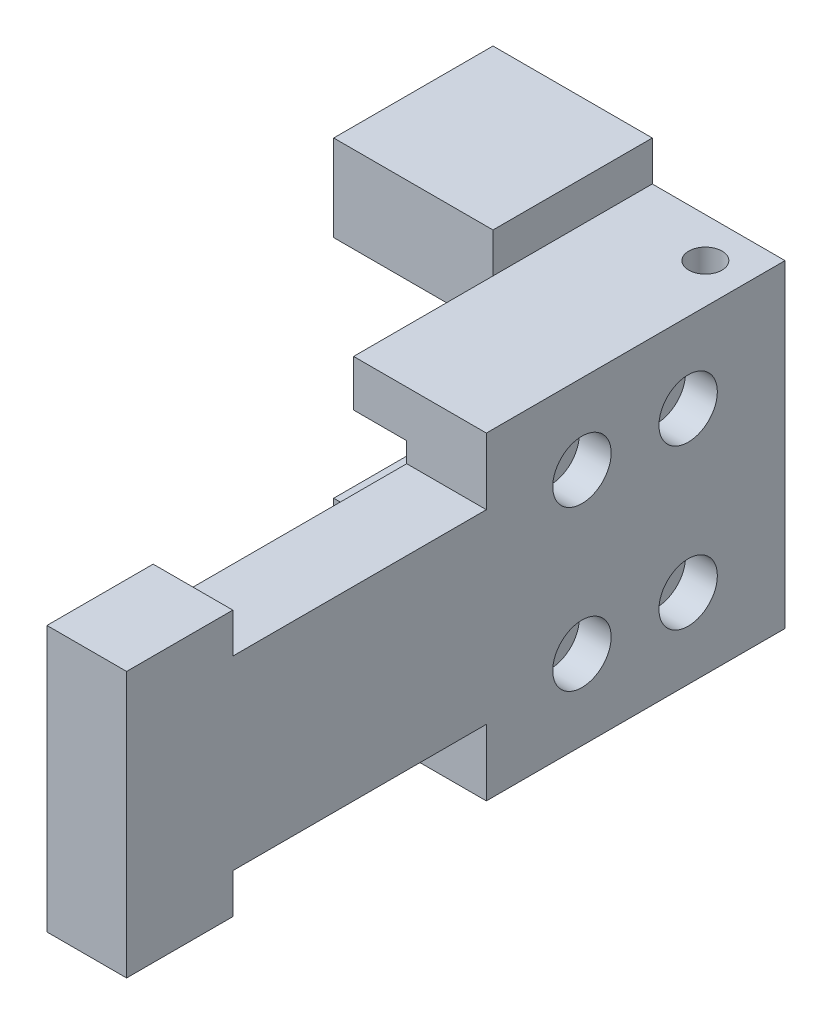
ISO-10303-21;
HEADER;
FILE_DESCRIPTION(('STEP AP214'),'2;1');
FILE_NAME('part.step','',(''),(''),'','','');
FILE_SCHEMA(('AUTOMOTIVE_DESIGN { 1 0 10303 214 1 1 1 1 }'));
ENDSEC;
DATA;
#1=APPLICATION_CONTEXT('core data for automotive mechanical design processes');
#2=APPLICATION_PROTOCOL_DEFINITION('international standard','automotive_design',2000,#1);
#3=PRODUCT_CONTEXT('',#1,'mechanical');
#4=PRODUCT('Part','Part','',(#3));
#5=PRODUCT_RELATED_PRODUCT_CATEGORY('part','',(#4));
#6=PRODUCT_DEFINITION_FORMATION('','',#4);
#7=PRODUCT_DEFINITION_CONTEXT('part definition',#1,'design');
#8=PRODUCT_DEFINITION('design','',#6,#7);
#9=PRODUCT_DEFINITION_SHAPE('','',#8);
#10=(LENGTH_UNIT() NAMED_UNIT(*) SI_UNIT(.MILLI.,.METRE.));
#11=(NAMED_UNIT(*) PLANE_ANGLE_UNIT() SI_UNIT($,.RADIAN.));
#12=(NAMED_UNIT(*) SI_UNIT($,.STERADIAN.) SOLID_ANGLE_UNIT());
#13=UNCERTAINTY_MEASURE_WITH_UNIT(LENGTH_MEASURE(1.E-05),#10,'distance_accuracy_value','');
#14=(GEOMETRIC_REPRESENTATION_CONTEXT(3) GLOBAL_UNCERTAINTY_ASSIGNED_CONTEXT((#13)) GLOBAL_UNIT_ASSIGNED_CONTEXT((#10,
#11,#12)) REPRESENTATION_CONTEXT('',''));
#15=CARTESIAN_POINT('',(0.,0.,0.));
#16=DIRECTION('',(0.,0.,1.));
#17=DIRECTION('',(1.,0.,0.));
#18=AXIS2_PLACEMENT_3D('',#15,#16,#17);
#19=CARTESIAN_POINT('',(0.,10.,49.6));
#20=DIRECTION('',(-1.,0.,0.));
#21=DIRECTION('',(0.,0.,1.));
#22=AXIS2_PLACEMENT_3D('',#19,#20,#21);
#23=PLANE('',#22);
#24=CARTESIAN_POINT('',(0.,6.,15.3));
#25=DIRECTION('',(1.,0.,0.));
#26=DIRECTION('',(0.,0.,-1.));
#27=AXIS2_PLACEMENT_3D('',#24,#25,#26);
#28=CIRCLE('',#27,2.19999999999999);
#29=CARTESIAN_POINT('',(0.,6.,13.1));
#30=VERTEX_POINT('',#29);
#31=EDGE_CURVE('E223',#30,#30,#28,.T.);
#32=ORIENTED_EDGE('',*,*,#31,.F.);
#33=EDGE_LOOP('',(#32));
#34=FACE_BOUND('',#33,.T.);
#35=CARTESIAN_POINT('',(0.,6.,7.3));
#36=DIRECTION('',(1.,0.,0.));
#37=DIRECTION('',(0.,0.,-1.));
#38=AXIS2_PLACEMENT_3D('',#35,#36,#37);
#39=CIRCLE('',#38,2.19999999999999);
#40=CARTESIAN_POINT('',(0.,6.,5.10000000000001));
#41=VERTEX_POINT('',#40);
#42=EDGE_CURVE('E234',#41,#41,#39,.T.);
#43=ORIENTED_EDGE('',*,*,#42,.F.);
#44=EDGE_LOOP('',(#43));
#45=FACE_BOUND('',#44,.T.);
#46=CARTESIAN_POINT('',(0.,-6.,15.3));
#47=DIRECTION('',(1.,0.,0.));
#48=DIRECTION('',(0.,0.,-1.));
#49=AXIS2_PLACEMENT_3D('',#46,#47,#48);
#50=CIRCLE('',#49,2.19999999999999);
#51=CARTESIAN_POINT('',(0.,-6.,13.1));
#52=VERTEX_POINT('',#51);
#53=EDGE_CURVE('E244',#52,#52,#50,.T.);
#54=ORIENTED_EDGE('',*,*,#53,.F.);
#55=EDGE_LOOP('',(#54));
#56=FACE_BOUND('',#55,.T.);
#57=CARTESIAN_POINT('',(0.,-6.,7.3));
#58=DIRECTION('',(1.,0.,0.));
#59=DIRECTION('',(0.,0.,-1.));
#60=AXIS2_PLACEMENT_3D('',#57,#58,#59);
#61=CIRCLE('',#60,2.19999999999999);
#62=CARTESIAN_POINT('',(0.,-6.,5.1));
#63=VERTEX_POINT('',#62);
#64=EDGE_CURVE('E254',#63,#63,#61,.T.);
#65=ORIENTED_EDGE('',*,*,#64,.F.);
#66=EDGE_LOOP('',(#65));
#67=FACE_BOUND('',#66,.T.);
#68=DIRECTION('',(0.,1.,0.));
#69=VECTOR('',#68,1.);
#70=CARTESIAN_POINT('',(0.,-10.,49.6));
#71=LINE('',#70,#69);
#72=CARTESIAN_POINT('',(0.,-10.,49.6));
#73=VERTEX_POINT('',#72);
#74=CARTESIAN_POINT('',(0.,10.,49.6));
#75=VERTEX_POINT('',#74);
#76=EDGE_CURVE('E348',#73,#75,#71,.T.);
#77=ORIENTED_EDGE('',*,*,#76,.F.);
#78=DIRECTION('',(0.,0.,1.));
#79=VECTOR('',#78,1.);
#80=CARTESIAN_POINT('',(0.,-10.,41.6));
#81=LINE('',#80,#79);
#82=CARTESIAN_POINT('',(0.,-10.,41.6));
#83=VERTEX_POINT('',#82);
#84=EDGE_CURVE('E55',#83,#73,#81,.T.);
#85=ORIENTED_EDGE('',*,*,#84,.F.);
#86=DIRECTION('',(0.,-1.,0.));
#87=VECTOR('',#86,1.);
#88=CARTESIAN_POINT('',(0.,-10.,41.6));
#89=LINE('',#88,#87);
#90=CARTESIAN_POINT('',(0.,-7.,41.6));
#91=VERTEX_POINT('',#90);
#92=EDGE_CURVE('E270',#91,#83,#89,.T.);
#93=ORIENTED_EDGE('',*,*,#92,.F.);
#94=DIRECTION('',(0.,0.,1.));
#95=VECTOR('',#94,1.);
#96=CARTESIAN_POINT('',(0.,-7.,22.5));
#97=LINE('',#96,#95);
#98=CARTESIAN_POINT('',(0.,-7.,22.5));
#99=VERTEX_POINT('',#98);
#100=EDGE_CURVE('E267',#99,#91,#97,.T.);
#101=ORIENTED_EDGE('',*,*,#100,.F.);
#102=DIRECTION('',(0.,1.,0.));
#103=VECTOR('',#102,1.);
#104=CARTESIAN_POINT('',(0.,-12.,22.5));
#105=LINE('',#104,#103);
#106=CARTESIAN_POINT('',(0.,-12.,22.5));
#107=VERTEX_POINT('',#106);
#108=EDGE_CURVE('E264',#107,#99,#105,.T.);
#109=ORIENTED_EDGE('',*,*,#108,.F.);
#110=DIRECTION('',(0.,0.,-1.));
#111=VECTOR('',#110,1.);
#112=CARTESIAN_POINT('',(0.,-12.,49.6));
#113=LINE('',#112,#111);
#114=CARTESIAN_POINT('',(0.,-12.,0.));
#115=VERTEX_POINT('',#114);
#116=EDGE_CURVE('E354',#107,#115,#113,.T.);
#117=ORIENTED_EDGE('',*,*,#116,.T.);
#118=DIRECTION('',(0.,1.,0.));
#119=VECTOR('',#118,1.);
#120=CARTESIAN_POINT('',(0.,10.,0.));
#121=LINE('',#120,#119);
#122=CARTESIAN_POINT('',(0.,12.,0.));
#123=VERTEX_POINT('',#122);
#124=EDGE_CURVE('E347',#115,#123,#121,.T.);
#125=ORIENTED_EDGE('',*,*,#124,.T.);
#126=DIRECTION('',(0.,0.,-1.));
#127=VECTOR('',#126,1.);
#128=CARTESIAN_POINT('',(0.,12.,49.6));
#129=LINE('',#128,#127);
#130=CARTESIAN_POINT('',(0.,12.,22.5));
#131=VERTEX_POINT('',#130);
#132=EDGE_CURVE('E411',#131,#123,#129,.T.);
#133=ORIENTED_EDGE('',*,*,#132,.F.);
#134=DIRECTION('',(0.,1.,0.));
#135=VECTOR('',#134,1.);
#136=CARTESIAN_POINT('',(0.,12.,22.5));
#137=LINE('',#136,#135);
#138=CARTESIAN_POINT('',(0.,7.,22.5));
#139=VERTEX_POINT('',#138);
#140=EDGE_CURVE('E286',#139,#131,#137,.T.);
#141=ORIENTED_EDGE('',*,*,#140,.F.);
#142=DIRECTION('',(0.,0.,-1.));
#143=VECTOR('',#142,1.);
#144=CARTESIAN_POINT('',(0.,7.,22.5));
#145=LINE('',#144,#143);
#146=CARTESIAN_POINT('',(0.,7.,41.6));
#147=VERTEX_POINT('',#146);
#148=EDGE_CURVE('E295',#147,#139,#145,.T.);
#149=ORIENTED_EDGE('',*,*,#148,.F.);
#150=DIRECTION('',(0.,-1.,0.));
#151=VECTOR('',#150,1.);
#152=CARTESIAN_POINT('',(0.,10.,41.6));
#153=LINE('',#152,#151);
#154=CARTESIAN_POINT('',(0.,10.,41.6));
#155=VERTEX_POINT('',#154);
#156=EDGE_CURVE('E292',#155,#147,#153,.T.);
#157=ORIENTED_EDGE('',*,*,#156,.F.);
#158=DIRECTION('',(0.,0.,-1.));
#159=VECTOR('',#158,1.);
#160=CARTESIAN_POINT('',(0.,10.,41.6));
#161=LINE('',#160,#159);
#162=EDGE_CURVE('E289',#75,#155,#161,.T.);
#163=ORIENTED_EDGE('',*,*,#162,.F.);
#164=EDGE_LOOP('',(#77,#85,#93,#101,#109,#117,#125,#133,#141,#149,#157,#163));
#165=FACE_BOUND('',#164,.T.);
#166=ADVANCED_FACE('F39',(#34,#45,#56,#67,#165),#23,.F.);
#167=CARTESIAN_POINT('',(-9.99999999999979,12.,49.6));
#168=DIRECTION('',(0.,-1.,0.));
#169=DIRECTION('',(0.,0.,-1.));
#170=AXIS2_PLACEMENT_3D('',#167,#168,#169);
#171=PLANE('',#170);
#172=CARTESIAN_POINT('',(-3.,12.,3.));
#173=DIRECTION('',(0.,1.,0.));
#174=DIRECTION('',(0.,0.,1.));
#175=AXIS2_PLACEMENT_3D('',#172,#173,#174);
#176=CIRCLE('',#175,1.25);
#177=CARTESIAN_POINT('',(-3.,12.,4.25));
#178=VERTEX_POINT('',#177);
#179=EDGE_CURVE('E209',#178,#178,#176,.T.);
#180=ORIENTED_EDGE('',*,*,#179,.F.);
#181=EDGE_LOOP('',(#180));
#182=FACE_BOUND('',#181,.T.);
#183=DIRECTION('',(1.,0.,0.));
#184=VECTOR('',#183,1.);
#185=CARTESIAN_POINT('',(-9.99999999999979,12.,22.5));
#186=LINE('',#185,#184);
#187=CARTESIAN_POINT('',(-10.,12.,22.5));
#188=VERTEX_POINT('',#187);
#189=EDGE_CURVE('E339',#188,#131,#186,.T.);
#190=ORIENTED_EDGE('',*,*,#189,.T.);
#191=ORIENTED_EDGE('',*,*,#132,.T.);
#192=DIRECTION('',(-1.,0.,0.));
#193=VECTOR('',#192,1.);
#194=CARTESIAN_POINT('',(-9.99999999999979,12.,0.));
#195=LINE('',#194,#193);
#196=CARTESIAN_POINT('',(-9.99999999999979,12.,0.));
#197=VERTEX_POINT('',#196);
#198=EDGE_CURVE('E357',#123,#197,#195,.T.);
#199=ORIENTED_EDGE('',*,*,#198,.T.);
#200=DIRECTION('',(0.,0.,-1.));
#201=VECTOR('',#200,1.);
#202=CARTESIAN_POINT('',(-9.99999999999979,12.,49.6));
#203=LINE('',#202,#201);
#204=CARTESIAN_POINT('',(-10.,12.,12.));
#205=VERTEX_POINT('',#204);
#206=EDGE_CURVE('E409',#205,#197,#203,.T.);
#207=ORIENTED_EDGE('',*,*,#206,.F.);
#208=DIRECTION('',(0.,0.,1.));
#209=VECTOR('',#208,1.);
#210=CARTESIAN_POINT('',(-10.,12.,49.6));
#211=LINE('',#210,#209);
#212=EDGE_CURVE('E330',#205,#188,#211,.T.);
#213=ORIENTED_EDGE('',*,*,#212,.T.);
#214=EDGE_LOOP('',(#190,#191,#199,#207,#213));
#215=FACE_BOUND('',#214,.T.);
#216=ADVANCED_FACE('F454',(#182,#215),#171,.F.);
#217=CARTESIAN_POINT('',(-9.99999999999979,15.,49.6));
#218=DIRECTION('',(-1.,0.,0.));
#219=DIRECTION('',(0.,0.,1.));
#220=AXIS2_PLACEMENT_3D('',#217,#218,#219);
#221=PLANE('',#220);
#222=DIRECTION('',(0.,0.,-1.));
#223=VECTOR('',#222,1.);
#224=CARTESIAN_POINT('',(-9.99999999999979,15.,49.6));
#225=LINE('',#224,#223);
#226=CARTESIAN_POINT('',(-10.,15.,12.));
#227=VERTEX_POINT('',#226);
#228=CARTESIAN_POINT('',(-9.99999999999979,15.,0.));
#229=VERTEX_POINT('',#228);
#230=EDGE_CURVE('E407',#227,#229,#225,.T.);
#231=ORIENTED_EDGE('',*,*,#230,.F.);
#232=DIRECTION('',(0.,-1.,0.));
#233=VECTOR('',#232,1.);
#234=CARTESIAN_POINT('',(-10.,15.,12.));
#235=LINE('',#234,#233);
#236=EDGE_CURVE('E317',#227,#205,#235,.T.);
#237=ORIENTED_EDGE('',*,*,#236,.T.);
#238=ORIENTED_EDGE('',*,*,#206,.T.);
#239=DIRECTION('',(0.,1.,0.));
#240=VECTOR('',#239,1.);
#241=CARTESIAN_POINT('',(-9.99999999999979,15.,0.));
#242=LINE('',#241,#240);
#243=EDGE_CURVE('E360',#197,#229,#242,.T.);
#244=ORIENTED_EDGE('',*,*,#243,.T.);
#245=EDGE_LOOP('',(#231,#237,#238,#244));
#246=FACE_BOUND('',#245,.T.);
#247=ADVANCED_FACE('F459',(#246),#221,.F.);
#248=CARTESIAN_POINT('',(-22.0000000000002,15.,49.6));
#249=DIRECTION('',(0.,-1.,0.));
#250=DIRECTION('',(0.,0.,-1.));
#251=AXIS2_PLACEMENT_3D('',#248,#249,#250);
#252=PLANE('',#251);
#253=DIRECTION('',(0.,0.,-1.));
#254=VECTOR('',#253,1.);
#255=CARTESIAN_POINT('',(-22.0000000000002,15.,49.6));
#256=LINE('',#255,#254);
#257=CARTESIAN_POINT('',(-22.0000000000002,15.,12.));
#258=VERTEX_POINT('',#257);
#259=CARTESIAN_POINT('',(-22.0000000000002,15.,0.));
#260=VERTEX_POINT('',#259);
#261=EDGE_CURVE('E405',#258,#260,#256,.T.);
#262=ORIENTED_EDGE('',*,*,#261,.F.);
#263=DIRECTION('',(1.,0.,0.));
#264=VECTOR('',#263,1.);
#265=CARTESIAN_POINT('',(-22.0000000000002,15.,12.));
#266=LINE('',#265,#264);
#267=EDGE_CURVE('E308',#258,#227,#266,.T.);
#268=ORIENTED_EDGE('',*,*,#267,.T.);
#269=ORIENTED_EDGE('',*,*,#230,.T.);
#270=DIRECTION('',(-1.,0.,0.));
#271=VECTOR('',#270,1.);
#272=CARTESIAN_POINT('',(-22.0000000000002,15.,0.));
#273=LINE('',#272,#271);
#274=EDGE_CURVE('E363',#229,#260,#273,.T.);
#275=ORIENTED_EDGE('',*,*,#274,.T.);
#276=EDGE_LOOP('',(#262,#268,#269,#275));
#277=FACE_BOUND('',#276,.T.);
#278=ADVANCED_FACE('F577',(#277),#252,.F.);
#279=CARTESIAN_POINT('',(-22.0000000000002,8.49999999999973,49.6));
#280=DIRECTION('',(1.,0.,0.));
#281=DIRECTION('',(0.,0.,-1.));
#282=AXIS2_PLACEMENT_3D('',#279,#280,#281);
#283=PLANE('',#282);
#284=DIRECTION('',(0.,0.,-1.));
#285=VECTOR('',#284,1.);
#286=CARTESIAN_POINT('',(-22.0000000000002,8.49999999999973,49.6));
#287=LINE('',#286,#285);
#288=CARTESIAN_POINT('',(-22.0000000000002,8.49999999999973,12.));
#289=VERTEX_POINT('',#288);
#290=CARTESIAN_POINT('',(-22.0000000000002,8.49999999999973,0.));
#291=VERTEX_POINT('',#290);
#292=EDGE_CURVE('E403',#289,#291,#287,.T.);
#293=ORIENTED_EDGE('',*,*,#292,.F.);
#294=DIRECTION('',(0.,-1.,0.));
#295=VECTOR('',#294,1.);
#296=CARTESIAN_POINT('',(-22.0000000000002,15.,12.));
#297=LINE('',#296,#295);
#298=EDGE_CURVE('E322',#258,#289,#297,.T.);
#299=ORIENTED_EDGE('',*,*,#298,.F.);
#300=ORIENTED_EDGE('',*,*,#261,.T.);
#301=DIRECTION('',(0.,-1.,0.));
#302=VECTOR('',#301,1.);
#303=CARTESIAN_POINT('',(-22.0000000000002,8.49999999999973,0.));
#304=LINE('',#303,#302);
#305=EDGE_CURVE('E366',#260,#291,#304,.T.);
#306=ORIENTED_EDGE('',*,*,#305,.T.);
#307=EDGE_LOOP('',(#293,#299,#300,#306));
#308=FACE_BOUND('',#307,.T.);
#309=ADVANCED_FACE('F573',(#308),#283,.F.);
#310=CARTESIAN_POINT('',(-6.00000000000023,8.49999999999973,49.6));
#311=DIRECTION('',(0.,1.,0.));
#312=DIRECTION('',(0.,0.,1.));
#313=AXIS2_PLACEMENT_3D('',#310,#311,#312);
#314=PLANE('',#313);
#315=DIRECTION('',(0.,0.,-1.));
#316=VECTOR('',#315,1.);
#317=CARTESIAN_POINT('',(-6.00000000000023,8.49999999999973,49.6));
#318=LINE('',#317,#316);
#319=CARTESIAN_POINT('',(-6.00000000000023,8.49999999999973,22.5));
#320=VERTEX_POINT('',#319);
#321=CARTESIAN_POINT('',(-6.00000000000023,8.49999999999973,0.));
#322=VERTEX_POINT('',#321);
#323=EDGE_CURVE('E401',#320,#322,#318,.T.);
#324=ORIENTED_EDGE('',*,*,#323,.F.);
#325=DIRECTION('',(-1.,0.,0.));
#326=VECTOR('',#325,1.);
#327=CARTESIAN_POINT('',(-6.00000000000023,8.49999999999973,22.5));
#328=LINE('',#327,#326);
#329=CARTESIAN_POINT('',(-10.,8.49999999999973,22.5));
#330=VERTEX_POINT('',#329);
#331=EDGE_CURVE('E336',#320,#330,#328,.T.);
#332=ORIENTED_EDGE('',*,*,#331,.T.);
#333=DIRECTION('',(0.,0.,-1.));
#334=VECTOR('',#333,1.);
#335=CARTESIAN_POINT('',(-10.,8.49999999999973,49.6));
#336=LINE('',#335,#334);
#337=CARTESIAN_POINT('',(-10.,8.49999999999973,12.));
#338=VERTEX_POINT('',#337);
#339=EDGE_CURVE('E327',#330,#338,#336,.T.);
#340=ORIENTED_EDGE('',*,*,#339,.T.);
#341=DIRECTION('',(-1.,0.,0.));
#342=VECTOR('',#341,1.);
#343=CARTESIAN_POINT('',(-6.00000000000023,8.49999999999973,12.));
#344=LINE('',#343,#342);
#345=EDGE_CURVE('E344',#338,#289,#344,.T.);
#346=ORIENTED_EDGE('',*,*,#345,.T.);
#347=ORIENTED_EDGE('',*,*,#292,.T.);
#348=DIRECTION('',(1.,0.,0.));
#349=VECTOR('',#348,1.);
#350=CARTESIAN_POINT('',(-6.00000000000023,8.49999999999973,0.));
#351=LINE('',#350,#349);
#352=EDGE_CURVE('E369',#291,#322,#351,.T.);
#353=ORIENTED_EDGE('',*,*,#352,.T.);
#354=EDGE_LOOP('',(#324,#332,#340,#346,#347,#353));
#355=FACE_BOUND('',#354,.T.);
#356=ADVANCED_FACE('F569',(#355),#314,.F.);
#357=CARTESIAN_POINT('',(-6.00000000000023,8.49999999999973,49.6));
#358=DIRECTION('',(1.,0.,0.));
#359=DIRECTION('',(0.,0.,-1.));
#360=AXIS2_PLACEMENT_3D('',#357,#358,#359);
#361=PLANE('',#360);
#362=CARTESIAN_POINT('',(-6.00000000000023,6.,15.3));
#363=DIRECTION('',(1.,0.,0.));
#364=DIRECTION('',(0.,0.,-1.));
#365=AXIS2_PLACEMENT_3D('',#362,#363,#364);
#366=CIRCLE('',#365,1.2);
#367=CARTESIAN_POINT('',(-6.00000000000023,6.,14.1));
#368=VERTEX_POINT('',#367);
#369=EDGE_CURVE('E42',#368,#368,#366,.T.);
#370=ORIENTED_EDGE('',*,*,#369,.T.);
#371=EDGE_LOOP('',(#370));
#372=FACE_BOUND('',#371,.T.);
#373=CARTESIAN_POINT('',(-6.00000000000023,6.,7.3));
#374=DIRECTION('',(1.,0.,0.));
#375=DIRECTION('',(0.,0.,-1.));
#376=AXIS2_PLACEMENT_3D('',#373,#374,#375);
#377=CIRCLE('',#376,1.2);
#378=CARTESIAN_POINT('',(-6.00000000000023,6.,6.1));
#379=VERTEX_POINT('',#378);
#380=EDGE_CURVE('E243',#379,#379,#377,.T.);
#381=ORIENTED_EDGE('',*,*,#380,.T.);
#382=EDGE_LOOP('',(#381));
#383=FACE_BOUND('',#382,.T.);
#384=CARTESIAN_POINT('',(-6.00000000000023,-6.,15.3));
#385=DIRECTION('',(1.,0.,0.));
#386=DIRECTION('',(0.,0.,-1.));
#387=AXIS2_PLACEMENT_3D('',#384,#385,#386);
#388=CIRCLE('',#387,1.2);
#389=CARTESIAN_POINT('',(-6.00000000000023,-6.,14.1));
#390=VERTEX_POINT('',#389);
#391=EDGE_CURVE('E253',#390,#390,#388,.T.);
#392=ORIENTED_EDGE('',*,*,#391,.T.);
#393=EDGE_LOOP('',(#392));
#394=FACE_BOUND('',#393,.T.);
#395=CARTESIAN_POINT('',(-6.00000000000023,-6.,7.3));
#396=DIRECTION('',(1.,0.,0.));
#397=DIRECTION('',(0.,0.,-1.));
#398=AXIS2_PLACEMENT_3D('',#395,#396,#397);
#399=CIRCLE('',#398,1.2);
#400=CARTESIAN_POINT('',(-6.00000000000023,-6.,6.1));
#401=VERTEX_POINT('',#400);
#402=EDGE_CURVE('E263',#401,#401,#399,.T.);
#403=ORIENTED_EDGE('',*,*,#402,.T.);
#404=EDGE_LOOP('',(#403));
#405=FACE_BOUND('',#404,.T.);
#406=DIRECTION('',(0.,-1.,0.));
#407=VECTOR('',#406,1.);
#408=CARTESIAN_POINT('',(-6.00000000000023,8.49999999999973,41.6));
#409=LINE('',#408,#407);
#410=CARTESIAN_POINT('',(-6.00000000000024,-7.,41.6));
#411=VERTEX_POINT('',#410);
#412=CARTESIAN_POINT('',(-6.00000000000024,-10.,41.6));
#413=VERTEX_POINT('',#412);
#414=EDGE_CURVE('E11',#411,#413,#409,.T.);
#415=ORIENTED_EDGE('',*,*,#414,.T.);
#416=DIRECTION('',(0.,0.,1.));
#417=VECTOR('',#416,1.);
#418=CARTESIAN_POINT('',(-6.00000000000023,-9.99999999999999,49.6));
#419=LINE('',#418,#417);
#420=CARTESIAN_POINT('',(-6.00000000000024,-10.,49.6));
#421=VERTEX_POINT('',#420);
#422=EDGE_CURVE('E283',#413,#421,#419,.T.);
#423=ORIENTED_EDGE('',*,*,#422,.T.);
#424=DIRECTION('',(0.,-1.,0.));
#425=VECTOR('',#424,1.);
#426=CARTESIAN_POINT('',(-6.00000000000023,8.49999999999973,49.6));
#427=LINE('',#426,#425);
#428=CARTESIAN_POINT('',(-6.00000000000023,10.,49.6));
#429=VERTEX_POINT('',#428);
#430=EDGE_CURVE('E350',#429,#421,#427,.T.);
#431=ORIENTED_EDGE('',*,*,#430,.F.);
#432=DIRECTION('',(0.,0.,-1.));
#433=VECTOR('',#432,1.);
#434=CARTESIAN_POINT('',(-6.00000000000023,10.,49.6));
#435=LINE('',#434,#433);
#436=CARTESIAN_POINT('',(-6.00000000000024,10.,41.6));
#437=VERTEX_POINT('',#436);
#438=EDGE_CURVE('E63',#429,#437,#435,.T.);
#439=ORIENTED_EDGE('',*,*,#438,.T.);
#440=DIRECTION('',(0.,-1.,0.));
#441=VECTOR('',#440,1.);
#442=CARTESIAN_POINT('',(-6.00000000000023,8.49999999999973,41.6));
#443=LINE('',#442,#441);
#444=CARTESIAN_POINT('',(-6.00000000000024,7.,41.6));
#445=VERTEX_POINT('',#444);
#446=EDGE_CURVE('E418',#437,#445,#443,.T.);
#447=ORIENTED_EDGE('',*,*,#446,.T.);
#448=DIRECTION('',(0.,0.,-1.));
#449=VECTOR('',#448,1.);
#450=CARTESIAN_POINT('',(-6.00000000000023,7.,49.6));
#451=LINE('',#450,#449);
#452=CARTESIAN_POINT('',(-6.00000000000024,7.,22.5));
#453=VERTEX_POINT('',#452);
#454=EDGE_CURVE('E421',#445,#453,#451,.T.);
#455=ORIENTED_EDGE('',*,*,#454,.T.);
#456=DIRECTION('',(0.,1.,0.));
#457=VECTOR('',#456,1.);
#458=CARTESIAN_POINT('',(-6.00000000000023,8.49999999999973,22.5));
#459=LINE('',#458,#457);
#460=EDGE_CURVE('E301',#453,#320,#459,.T.);
#461=ORIENTED_EDGE('',*,*,#460,.T.);
#462=ORIENTED_EDGE('',*,*,#323,.T.);
#463=DIRECTION('',(0.,-1.,0.));
#464=VECTOR('',#463,1.);
#465=CARTESIAN_POINT('',(-6.00000000000023,8.49999999999973,0.));
#466=LINE('',#465,#464);
#467=CARTESIAN_POINT('',(-6.00000000000023,-8.49999999999995,0.));
#468=VERTEX_POINT('',#467);
#469=EDGE_CURVE('E372',#322,#468,#466,.T.);
#470=ORIENTED_EDGE('',*,*,#469,.T.);
#471=DIRECTION('',(0.,0.,-1.));
#472=VECTOR('',#471,1.);
#473=CARTESIAN_POINT('',(-6.00000000000023,-8.49999999999995,49.6));
#474=LINE('',#473,#472);
#475=CARTESIAN_POINT('',(-6.00000000000023,-8.49999999999995,22.5));
#476=VERTEX_POINT('',#475);
#477=EDGE_CURVE('E399',#476,#468,#474,.T.);
#478=ORIENTED_EDGE('',*,*,#477,.F.);
#479=DIRECTION('',(0.,1.,0.));
#480=VECTOR('',#479,1.);
#481=CARTESIAN_POINT('',(-6.00000000000023,8.49999999999973,22.5));
#482=LINE('',#481,#480);
#483=CARTESIAN_POINT('',(-6.00000000000024,-7.,22.5));
#484=VERTEX_POINT('',#483);
#485=EDGE_CURVE('E277',#476,#484,#482,.T.);
#486=ORIENTED_EDGE('',*,*,#485,.T.);
#487=DIRECTION('',(0.,0.,1.));
#488=VECTOR('',#487,1.);
#489=CARTESIAN_POINT('',(-6.00000000000023,-7.,49.6));
#490=LINE('',#489,#488);
#491=EDGE_CURVE('E47',#484,#411,#490,.T.);
#492=ORIENTED_EDGE('',*,*,#491,.T.);
#493=EDGE_LOOP('',(#415,#423,#431,#439,#447,#455,#461,#462,#470,#478,#486,#492));
#494=FACE_BOUND('',#493,.T.);
#495=ADVANCED_FACE('F434',(#372,#383,#394,#405,#494),#361,.F.);
#496=CARTESIAN_POINT('',(-22.0000000000002,-8.49999999999995,49.6));
#497=DIRECTION('',(0.,-1.,0.));
#498=DIRECTION('',(0.,0.,-1.));
#499=AXIS2_PLACEMENT_3D('',#496,#497,#498);
#500=PLANE('',#499);
#501=DIRECTION('',(0.,0.,1.));
#502=VECTOR('',#501,1.);
#503=CARTESIAN_POINT('',(-10.,-8.49999999999995,49.6));
#504=LINE('',#503,#502);
#505=CARTESIAN_POINT('',(-10.,-8.49999999999995,12.));
#506=VERTEX_POINT('',#505);
#507=CARTESIAN_POINT('',(-10.,-8.49999999999995,22.5));
#508=VERTEX_POINT('',#507);
#509=EDGE_CURVE('E324',#506,#508,#504,.T.);
#510=ORIENTED_EDGE('',*,*,#509,.T.);
#511=DIRECTION('',(1.,0.,0.));
#512=VECTOR('',#511,1.);
#513=CARTESIAN_POINT('',(-22.0000000000002,-8.49999999999995,22.5));
#514=LINE('',#513,#512);
#515=EDGE_CURVE('E333',#508,#476,#514,.T.);
#516=ORIENTED_EDGE('',*,*,#515,.T.);
#517=ORIENTED_EDGE('',*,*,#477,.T.);
#518=DIRECTION('',(-1.,0.,0.));
#519=VECTOR('',#518,1.);
#520=CARTESIAN_POINT('',(-22.0000000000002,-8.49999999999995,0.));
#521=LINE('',#520,#519);
#522=CARTESIAN_POINT('',(-22.0000000000002,-8.49999999999995,0.));
#523=VERTEX_POINT('',#522);
#524=EDGE_CURVE('E375',#468,#523,#521,.T.);
#525=ORIENTED_EDGE('',*,*,#524,.T.);
#526=DIRECTION('',(0.,0.,-1.));
#527=VECTOR('',#526,1.);
#528=CARTESIAN_POINT('',(-22.0000000000002,-8.49999999999995,49.6));
#529=LINE('',#528,#527);
#530=CARTESIAN_POINT('',(-22.0000000000002,-8.49999999999995,12.));
#531=VERTEX_POINT('',#530);
#532=EDGE_CURVE('E397',#531,#523,#529,.T.);
#533=ORIENTED_EDGE('',*,*,#532,.F.);
#534=DIRECTION('',(1.,0.,0.));
#535=VECTOR('',#534,1.);
#536=CARTESIAN_POINT('',(-22.0000000000002,-8.49999999999995,12.));
#537=LINE('',#536,#535);
#538=EDGE_CURVE('E341',#531,#506,#537,.T.);
#539=ORIENTED_EDGE('',*,*,#538,.T.);
#540=EDGE_LOOP('',(#510,#516,#517,#525,#533,#539));
#541=FACE_BOUND('',#540,.T.);
#542=ADVANCED_FACE('F562',(#541),#500,.F.);
#543=CARTESIAN_POINT('',(-22.0000000000002,-15.,49.6));
#544=DIRECTION('',(1.,0.,0.));
#545=DIRECTION('',(0.,0.,-1.));
#546=AXIS2_PLACEMENT_3D('',#543,#544,#545);
#547=PLANE('',#546);
#548=DIRECTION('',(0.,0.,-1.));
#549=VECTOR('',#548,1.);
#550=CARTESIAN_POINT('',(-22.0000000000002,-15.,49.6));
#551=LINE('',#550,#549);
#552=CARTESIAN_POINT('',(-22.0000000000002,-15.,12.));
#553=VERTEX_POINT('',#552);
#554=CARTESIAN_POINT('',(-22.0000000000002,-15.,0.));
#555=VERTEX_POINT('',#554);
#556=EDGE_CURVE('E395',#553,#555,#551,.T.);
#557=ORIENTED_EDGE('',*,*,#556,.F.);
#558=EDGE_CURVE('E311',#531,#553,#297,.T.);
#559=ORIENTED_EDGE('',*,*,#558,.F.);
#560=ORIENTED_EDGE('',*,*,#532,.T.);
#561=DIRECTION('',(0.,-1.,0.));
#562=VECTOR('',#561,1.);
#563=CARTESIAN_POINT('',(-22.0000000000002,-15.,0.));
#564=LINE('',#563,#562);
#565=EDGE_CURVE('E378',#523,#555,#564,.T.);
#566=ORIENTED_EDGE('',*,*,#565,.T.);
#567=EDGE_LOOP('',(#557,#559,#560,#566));
#568=FACE_BOUND('',#567,.T.);
#569=ADVANCED_FACE('F558',(#568),#547,.F.);
#570=CARTESIAN_POINT('',(-9.99999999999979,-15.,49.6));
#571=DIRECTION('',(0.,1.,0.));
#572=DIRECTION('',(0.,0.,1.));
#573=AXIS2_PLACEMENT_3D('',#570,#571,#572);
#574=PLANE('',#573);
#575=DIRECTION('',(0.,0.,-1.));
#576=VECTOR('',#575,1.);
#577=CARTESIAN_POINT('',(-9.99999999999979,-15.,49.6));
#578=LINE('',#577,#576);
#579=CARTESIAN_POINT('',(-10.,-15.,12.));
#580=VERTEX_POINT('',#579);
#581=CARTESIAN_POINT('',(-9.99999999999979,-15.,0.));
#582=VERTEX_POINT('',#581);
#583=EDGE_CURVE('E393',#580,#582,#578,.T.);
#584=ORIENTED_EDGE('',*,*,#583,.F.);
#585=DIRECTION('',(1.,0.,0.));
#586=VECTOR('',#585,1.);
#587=CARTESIAN_POINT('',(-22.0000000000002,-15.,12.));
#588=LINE('',#587,#586);
#589=EDGE_CURVE('E307',#553,#580,#588,.T.);
#590=ORIENTED_EDGE('',*,*,#589,.F.);
#591=ORIENTED_EDGE('',*,*,#556,.T.);
#592=DIRECTION('',(1.,0.,0.));
#593=VECTOR('',#592,1.);
#594=CARTESIAN_POINT('',(-9.99999999999979,-15.,0.));
#595=LINE('',#594,#593);
#596=EDGE_CURVE('E381',#555,#582,#595,.T.);
#597=ORIENTED_EDGE('',*,*,#596,.T.);
#598=EDGE_LOOP('',(#584,#590,#591,#597));
#599=FACE_BOUND('',#598,.T.);
#600=ADVANCED_FACE('F554',(#599),#574,.F.);
#601=CARTESIAN_POINT('',(-9.99999999999979,-15.,49.6));
#602=DIRECTION('',(-1.,0.,0.));
#603=DIRECTION('',(0.,0.,1.));
#604=AXIS2_PLACEMENT_3D('',#601,#602,#603);
#605=PLANE('',#604);
#606=DIRECTION('',(0.,0.,-1.));
#607=VECTOR('',#606,1.);
#608=CARTESIAN_POINT('',(-9.99999999999979,-12.,49.6));
#609=LINE('',#608,#607);
#610=CARTESIAN_POINT('',(-10.,-12.,12.));
#611=VERTEX_POINT('',#610);
#612=CARTESIAN_POINT('',(-9.99999999999979,-12.,0.));
#613=VERTEX_POINT('',#612);
#614=EDGE_CURVE('E390',#611,#613,#609,.T.);
#615=ORIENTED_EDGE('',*,*,#614,.F.);
#616=EDGE_CURVE('E321',#611,#580,#235,.T.);
#617=ORIENTED_EDGE('',*,*,#616,.T.);
#618=ORIENTED_EDGE('',*,*,#583,.T.);
#619=DIRECTION('',(0.,1.,0.));
#620=VECTOR('',#619,1.);
#621=CARTESIAN_POINT('',(-9.99999999999979,-15.,0.));
#622=LINE('',#621,#620);
#623=EDGE_CURVE('E384',#582,#613,#622,.T.);
#624=ORIENTED_EDGE('',*,*,#623,.T.);
#625=EDGE_LOOP('',(#615,#617,#618,#624));
#626=FACE_BOUND('',#625,.T.);
#627=ADVANCED_FACE('F551',(#626),#605,.F.);
#628=CARTESIAN_POINT('',(-9.99999999999979,-12.,49.6));
#629=DIRECTION('',(0.,1.,0.));
#630=DIRECTION('',(0.,0.,1.));
#631=AXIS2_PLACEMENT_3D('',#628,#629,#630);
#632=PLANE('',#631);
#633=ORIENTED_EDGE('',*,*,#116,.F.);
#634=DIRECTION('',(-1.,0.,0.));
#635=VECTOR('',#634,1.);
#636=CARTESIAN_POINT('',(-9.99999999999979,-12.,22.5));
#637=LINE('',#636,#635);
#638=CARTESIAN_POINT('',(-10.,-12.,22.5));
#639=VERTEX_POINT('',#638);
#640=EDGE_CURVE('E413',#107,#639,#637,.T.);
#641=ORIENTED_EDGE('',*,*,#640,.T.);
#642=EDGE_CURVE('E392',#639,#611,#609,.T.);
#643=ORIENTED_EDGE('',*,*,#642,.T.);
#644=ORIENTED_EDGE('',*,*,#614,.T.);
#645=DIRECTION('',(1.,0.,0.));
#646=VECTOR('',#645,1.);
#647=CARTESIAN_POINT('',(-9.99999999999979,-12.,0.));
#648=LINE('',#647,#646);
#649=EDGE_CURVE('E351',#613,#115,#648,.T.);
#650=ORIENTED_EDGE('',*,*,#649,.T.);
#651=EDGE_LOOP('',(#633,#641,#643,#644,#650));
#652=FACE_BOUND('',#651,.T.);
#653=ADVANCED_FACE('F499',(#652),#632,.F.);
#654=CARTESIAN_POINT('',(0.,0.,49.6));
#655=DIRECTION('',(0.,0.,1.));
#656=DIRECTION('',(1.,0.,0.));
#657=AXIS2_PLACEMENT_3D('',#654,#655,#656);
#658=PLANE('',#657);
#659=DIRECTION('',(-1.,0.,0.));
#660=VECTOR('',#659,1.);
#661=CARTESIAN_POINT('',(0.,-10.,49.6));
#662=LINE('',#661,#660);
#663=EDGE_CURVE('E424',#73,#421,#662,.T.);
#664=ORIENTED_EDGE('',*,*,#663,.F.);
#665=ORIENTED_EDGE('',*,*,#76,.T.);
#666=DIRECTION('',(1.,0.,0.));
#667=VECTOR('',#666,1.);
#668=CARTESIAN_POINT('',(0.,10.,49.6));
#669=LINE('',#668,#667);
#670=EDGE_CURVE('E416',#429,#75,#669,.T.);
#671=ORIENTED_EDGE('',*,*,#670,.F.);
#672=ORIENTED_EDGE('',*,*,#430,.T.);
#673=EDGE_LOOP('',(#664,#665,#671,#672));
#674=FACE_BOUND('',#673,.T.);
#675=ADVANCED_FACE('F474',(#674),#658,.T.);
#676=CARTESIAN_POINT('',(0.,0.,0.));
#677=DIRECTION('',(0.,0.,1.));
#678=DIRECTION('',(1.,0.,0.));
#679=AXIS2_PLACEMENT_3D('',#676,#677,#678);
#680=PLANE('',#679);
#681=CARTESIAN_POINT('',(-17.,11.75,0.));
#682=DIRECTION('',(0.,0.,-1.));
#683=DIRECTION('',(1.,0.,0.));
#684=AXIS2_PLACEMENT_3D('',#681,#682,#683);
#685=CIRCLE('',#684,2.55);
#686=CARTESIAN_POINT('',(-14.45,11.75,0.));
#687=VERTEX_POINT('',#686);
#688=EDGE_CURVE('E208',#687,#687,#685,.T.);
#689=ORIENTED_EDGE('',*,*,#688,.F.);
#690=EDGE_LOOP('',(#689));
#691=FACE_BOUND('',#690,.T.);
#692=CARTESIAN_POINT('',(-17.,-11.75,0.));
#693=DIRECTION('',(0.,0.,-1.));
#694=DIRECTION('',(-1.,0.,0.));
#695=AXIS2_PLACEMENT_3D('',#692,#693,#694);
#696=CIRCLE('',#695,2.55);
#697=CARTESIAN_POINT('',(-19.55,-11.75,0.));
#698=VERTEX_POINT('',#697);
#699=EDGE_CURVE('E218',#698,#698,#696,.T.);
#700=ORIENTED_EDGE('',*,*,#699,.F.);
#701=EDGE_LOOP('',(#700));
#702=FACE_BOUND('',#701,.T.);
#703=ORIENTED_EDGE('',*,*,#124,.F.);
#704=ORIENTED_EDGE('',*,*,#649,.F.);
#705=ORIENTED_EDGE('',*,*,#623,.F.);
#706=ORIENTED_EDGE('',*,*,#596,.F.);
#707=ORIENTED_EDGE('',*,*,#565,.F.);
#708=ORIENTED_EDGE('',*,*,#524,.F.);
#709=ORIENTED_EDGE('',*,*,#469,.F.);
#710=ORIENTED_EDGE('',*,*,#352,.F.);
#711=ORIENTED_EDGE('',*,*,#305,.F.);
#712=ORIENTED_EDGE('',*,*,#274,.F.);
#713=ORIENTED_EDGE('',*,*,#243,.F.);
#714=ORIENTED_EDGE('',*,*,#198,.F.);
#715=EDGE_LOOP('',(#703,#704,#705,#706,#707,#708,#709,#710,#711,#712,#713,#714));
#716=FACE_BOUND('',#715,.T.);
#717=ADVANCED_FACE('F505',(#691,#702,#716),#680,.F.);
#718=CARTESIAN_POINT('',(-22.0000000000002,15.,12.));
#719=DIRECTION('',(0.,0.,-1.));
#720=DIRECTION('',(-1.,0.,0.));
#721=AXIS2_PLACEMENT_3D('',#718,#719,#720);
#722=PLANE('',#721);
#723=EDGE_CURVE('E320',#205,#338,#235,.T.);
#724=ORIENTED_EDGE('',*,*,#723,.F.);
#725=ORIENTED_EDGE('',*,*,#236,.F.);
#726=ORIENTED_EDGE('',*,*,#267,.F.);
#727=ORIENTED_EDGE('',*,*,#298,.T.);
#728=ORIENTED_EDGE('',*,*,#345,.F.);
#729=EDGE_LOOP('',(#724,#725,#726,#727,#728));
#730=FACE_BOUND('',#729,.T.);
#731=ADVANCED_FACE('F539',(#730),#722,.F.);
#732=CARTESIAN_POINT('',(-10.,15.,22.5));
#733=DIRECTION('',(1.,0.,0.));
#734=DIRECTION('',(0.,0.,-1.));
#735=AXIS2_PLACEMENT_3D('',#732,#733,#734);
#736=PLANE('',#735);
#737=ORIENTED_EDGE('',*,*,#723,.T.);
#738=ORIENTED_EDGE('',*,*,#339,.F.);
#739=DIRECTION('',(0.,-1.,0.));
#740=VECTOR('',#739,1.);
#741=CARTESIAN_POINT('',(-10.,15.,22.5));
#742=LINE('',#741,#740);
#743=EDGE_CURVE('E316',#188,#330,#742,.T.);
#744=ORIENTED_EDGE('',*,*,#743,.F.);
#745=ORIENTED_EDGE('',*,*,#212,.F.);
#746=EDGE_LOOP('',(#737,#738,#744,#745));
#747=FACE_BOUND('',#746,.T.);
#748=ADVANCED_FACE('F529',(#747),#736,.F.);
#749=CARTESIAN_POINT('',(-10.,15.,22.5));
#750=DIRECTION('',(0.,0.,-1.));
#751=DIRECTION('',(-1.,0.,0.));
#752=AXIS2_PLACEMENT_3D('',#749,#750,#751);
#753=PLANE('',#752);
#754=ORIENTED_EDGE('',*,*,#743,.T.);
#755=ORIENTED_EDGE('',*,*,#331,.F.);
#756=ORIENTED_EDGE('',*,*,#460,.F.);
#757=DIRECTION('',(1.,0.,0.));
#758=VECTOR('',#757,1.);
#759=CARTESIAN_POINT('',(-49.6,7.,22.5));
#760=LINE('',#759,#758);
#761=EDGE_CURVE('E299',#453,#139,#760,.T.);
#762=ORIENTED_EDGE('',*,*,#761,.T.);
#763=ORIENTED_EDGE('',*,*,#140,.T.);
#764=ORIENTED_EDGE('',*,*,#189,.F.);
#765=EDGE_LOOP('',(#754,#755,#756,#762,#763,#764));
#766=FACE_BOUND('',#765,.T.);
#767=ADVANCED_FACE('F513',(#766),#753,.F.);
#768=ORIENTED_EDGE('',*,*,#558,.T.);
#769=ORIENTED_EDGE('',*,*,#589,.T.);
#770=ORIENTED_EDGE('',*,*,#616,.F.);
#771=EDGE_CURVE('E599',#506,#611,#235,.T.);
#772=ORIENTED_EDGE('',*,*,#771,.F.);
#773=ORIENTED_EDGE('',*,*,#538,.F.);
#774=EDGE_LOOP('',(#768,#769,#770,#772,#773));
#775=FACE_BOUND('',#774,.T.);
#776=ADVANCED_FACE('F536',(#775),#722,.F.);
#777=EDGE_CURVE('E313',#508,#639,#742,.T.);
#778=ORIENTED_EDGE('',*,*,#777,.T.);
#779=ORIENTED_EDGE('',*,*,#640,.F.);
#780=ORIENTED_EDGE('',*,*,#108,.T.);
#781=DIRECTION('',(1.,0.,0.));
#782=VECTOR('',#781,1.);
#783=CARTESIAN_POINT('',(-49.6,-7.,22.5));
#784=LINE('',#783,#782);
#785=EDGE_CURVE('E274',#484,#99,#784,.T.);
#786=ORIENTED_EDGE('',*,*,#785,.F.);
#787=ORIENTED_EDGE('',*,*,#485,.F.);
#788=ORIENTED_EDGE('',*,*,#515,.F.);
#789=EDGE_LOOP('',(#778,#779,#780,#786,#787,#788));
#790=FACE_BOUND('',#789,.T.);
#791=ADVANCED_FACE('F495',(#790),#753,.F.);
#792=ORIENTED_EDGE('',*,*,#771,.T.);
#793=ORIENTED_EDGE('',*,*,#642,.F.);
#794=ORIENTED_EDGE('',*,*,#777,.F.);
#795=ORIENTED_EDGE('',*,*,#509,.F.);
#796=EDGE_LOOP('',(#792,#793,#794,#795));
#797=FACE_BOUND('',#796,.T.);
#798=ADVANCED_FACE('F520',(#797),#736,.F.);
#799=CARTESIAN_POINT('',(-49.6,7.,22.5));
#800=DIRECTION('',(0.,-1.,0.));
#801=DIRECTION('',(0.,0.,-1.));
#802=AXIS2_PLACEMENT_3D('',#799,#800,#801);
#803=PLANE('',#802);
#804=DIRECTION('',(1.,0.,0.));
#805=VECTOR('',#804,1.);
#806=CARTESIAN_POINT('',(-49.6,7.,41.6));
#807=LINE('',#806,#805);
#808=EDGE_CURVE('E302',#445,#147,#807,.T.);
#809=ORIENTED_EDGE('',*,*,#808,.T.);
#810=ORIENTED_EDGE('',*,*,#148,.T.);
#811=ORIENTED_EDGE('',*,*,#761,.F.);
#812=ORIENTED_EDGE('',*,*,#454,.F.);
#813=EDGE_LOOP('',(#809,#810,#811,#812));
#814=FACE_BOUND('',#813,.T.);
#815=ADVANCED_FACE('F518',(#814),#803,.F.);
#816=CARTESIAN_POINT('',(-49.6,10.,41.6));
#817=DIRECTION('',(0.,0.,1.));
#818=DIRECTION('',(1.,0.,0.));
#819=AXIS2_PLACEMENT_3D('',#816,#817,#818);
#820=PLANE('',#819);
#821=DIRECTION('',(1.,0.,0.));
#822=VECTOR('',#821,1.);
#823=CARTESIAN_POINT('',(-49.6,10.,41.6));
#824=LINE('',#823,#822);
#825=EDGE_CURVE('E298',#437,#155,#824,.T.);
#826=ORIENTED_EDGE('',*,*,#825,.T.);
#827=ORIENTED_EDGE('',*,*,#156,.T.);
#828=ORIENTED_EDGE('',*,*,#808,.F.);
#829=ORIENTED_EDGE('',*,*,#446,.F.);
#830=EDGE_LOOP('',(#826,#827,#828,#829));
#831=FACE_BOUND('',#830,.T.);
#832=ADVANCED_FACE('F481',(#831),#820,.F.);
#833=CARTESIAN_POINT('',(-49.6,10.,41.6));
#834=DIRECTION('',(0.,-1.,0.));
#835=DIRECTION('',(0.,0.,-1.));
#836=AXIS2_PLACEMENT_3D('',#833,#834,#835);
#837=PLANE('',#836);
#838=ORIENTED_EDGE('',*,*,#670,.T.);
#839=ORIENTED_EDGE('',*,*,#162,.T.);
#840=ORIENTED_EDGE('',*,*,#825,.F.);
#841=ORIENTED_EDGE('',*,*,#438,.F.);
#842=EDGE_LOOP('',(#838,#839,#840,#841));
#843=FACE_BOUND('',#842,.T.);
#844=ADVANCED_FACE('F476',(#843),#837,.F.);
#845=CARTESIAN_POINT('',(-49.6,-10.,41.6));
#846=DIRECTION('',(0.,0.,1.));
#847=DIRECTION('',(1.,0.,0.));
#848=AXIS2_PLACEMENT_3D('',#845,#846,#847);
#849=PLANE('',#848);
#850=DIRECTION('',(1.,0.,0.));
#851=VECTOR('',#850,1.);
#852=CARTESIAN_POINT('',(-49.6,-7.,41.6));
#853=LINE('',#852,#851);
#854=EDGE_CURVE('E278',#411,#91,#853,.T.);
#855=ORIENTED_EDGE('',*,*,#854,.T.);
#856=ORIENTED_EDGE('',*,*,#92,.T.);
#857=DIRECTION('',(1.,0.,0.));
#858=VECTOR('',#857,1.);
#859=CARTESIAN_POINT('',(-49.6,-10.,41.6));
#860=LINE('',#859,#858);
#861=EDGE_CURVE('E275',#413,#83,#860,.T.);
#862=ORIENTED_EDGE('',*,*,#861,.F.);
#863=ORIENTED_EDGE('',*,*,#414,.F.);
#864=EDGE_LOOP('',(#855,#856,#862,#863));
#865=FACE_BOUND('',#864,.T.);
#866=ADVANCED_FACE('F486',(#865),#849,.F.);
#867=CARTESIAN_POINT('',(-49.6,-7.,22.5));
#868=DIRECTION('',(0.,1.,0.));
#869=DIRECTION('',(0.,0.,1.));
#870=AXIS2_PLACEMENT_3D('',#867,#868,#869);
#871=PLANE('',#870);
#872=ORIENTED_EDGE('',*,*,#785,.T.);
#873=ORIENTED_EDGE('',*,*,#100,.T.);
#874=ORIENTED_EDGE('',*,*,#854,.F.);
#875=ORIENTED_EDGE('',*,*,#491,.F.);
#876=EDGE_LOOP('',(#872,#873,#874,#875));
#877=FACE_BOUND('',#876,.T.);
#878=ADVANCED_FACE('F492',(#877),#871,.F.);
#879=CARTESIAN_POINT('',(-49.6,-10.,41.6));
#880=DIRECTION('',(0.,1.,0.));
#881=DIRECTION('',(0.,0.,1.));
#882=AXIS2_PLACEMENT_3D('',#879,#880,#881);
#883=PLANE('',#882);
#884=ORIENTED_EDGE('',*,*,#861,.T.);
#885=ORIENTED_EDGE('',*,*,#84,.T.);
#886=ORIENTED_EDGE('',*,*,#663,.T.);
#887=ORIENTED_EDGE('',*,*,#422,.F.);
#888=EDGE_LOOP('',(#884,#885,#886,#887));
#889=FACE_BOUND('',#888,.T.);
#890=ADVANCED_FACE('F484',(#889),#883,.F.);
#891=CARTESIAN_POINT('',(0.,-6.,7.3));
#892=DIRECTION('',(1.,0.,0.));
#893=DIRECTION('',(0.,0.,-1.));
#894=AXIS2_PLACEMENT_3D('',#891,#892,#893);
#895=CYLINDRICAL_SURFACE('',#894,1.2);
#896=CARTESIAN_POINT('',(-2.4,-6.,7.3));
#897=DIRECTION('',(1.,0.,0.));
#898=DIRECTION('',(0.,0.,-1.));
#899=AXIS2_PLACEMENT_3D('',#896,#897,#898);
#900=CIRCLE('',#899,1.2);
#901=CARTESIAN_POINT('',(-2.4,-6.,6.1));
#902=VERTEX_POINT('',#901);
#903=EDGE_CURVE('E260',#902,#902,#900,.T.);
#904=ORIENTED_EDGE('',*,*,#903,.T.);
#905=EDGE_LOOP('',(#904));
#906=FACE_BOUND('',#905,.T.);
#907=ORIENTED_EDGE('',*,*,#402,.F.);
#908=EDGE_LOOP('',(#907));
#909=FACE_BOUND('',#908,.T.);
#910=ADVANCED_FACE('F836',(#906,#909),#895,.F.);
#911=CARTESIAN_POINT('',(-2.4,-4.8,7.3));
#912=DIRECTION('',(-1.,0.,0.));
#913=DIRECTION('',(0.,0.,1.));
#914=AXIS2_PLACEMENT_3D('',#911,#912,#913);
#915=PLANE('',#914);
#916=ORIENTED_EDGE('',*,*,#903,.F.);
#917=EDGE_LOOP('',(#916));
#918=FACE_BOUND('',#917,.T.);
#919=CARTESIAN_POINT('',(-2.4,-6.,7.3));
#920=DIRECTION('',(1.,0.,0.));
#921=DIRECTION('',(0.,0.,-1.));
#922=AXIS2_PLACEMENT_3D('',#919,#920,#921);
#923=CIRCLE('',#922,2.19999999999999);
#924=CARTESIAN_POINT('',(-2.4,-6.,5.1));
#925=VERTEX_POINT('',#924);
#926=EDGE_CURVE('E257',#925,#925,#923,.T.);
#927=ORIENTED_EDGE('',*,*,#926,.T.);
#928=EDGE_LOOP('',(#927));
#929=FACE_BOUND('',#928,.T.);
#930=ADVANCED_FACE('F827',(#918,#929),#915,.F.);
#931=CARTESIAN_POINT('',(0.,-6.,7.3));
#932=DIRECTION('',(1.,0.,0.));
#933=DIRECTION('',(0.,0.,-1.));
#934=AXIS2_PLACEMENT_3D('',#931,#932,#933);
#935=CYLINDRICAL_SURFACE('',#934,2.19999999999999);
#936=ORIENTED_EDGE('',*,*,#926,.F.);
#937=EDGE_LOOP('',(#936));
#938=FACE_BOUND('',#937,.T.);
#939=ORIENTED_EDGE('',*,*,#64,.T.);
#940=EDGE_LOOP('',(#939));
#941=FACE_BOUND('',#940,.T.);
#942=ADVANCED_FACE('F818',(#938,#941),#935,.F.);
#943=CARTESIAN_POINT('',(0.,-6.,15.3));
#944=DIRECTION('',(1.,0.,0.));
#945=DIRECTION('',(0.,0.,-1.));
#946=AXIS2_PLACEMENT_3D('',#943,#944,#945);
#947=CYLINDRICAL_SURFACE('',#946,1.2);
#948=CARTESIAN_POINT('',(-2.4,-6.,15.3));
#949=DIRECTION('',(1.,0.,0.));
#950=DIRECTION('',(0.,0.,-1.));
#951=AXIS2_PLACEMENT_3D('',#948,#949,#950);
#952=CIRCLE('',#951,1.2);
#953=CARTESIAN_POINT('',(-2.4,-6.,14.1));
#954=VERTEX_POINT('',#953);
#955=EDGE_CURVE('E250',#954,#954,#952,.T.);
#956=ORIENTED_EDGE('',*,*,#955,.T.);
#957=EDGE_LOOP('',(#956));
#958=FACE_BOUND('',#957,.T.);
#959=ORIENTED_EDGE('',*,*,#391,.F.);
#960=EDGE_LOOP('',(#959));
#961=FACE_BOUND('',#960,.T.);
#962=ADVANCED_FACE('F809',(#958,#961),#947,.F.);
#963=CARTESIAN_POINT('',(-2.4,-4.8,15.3));
#964=DIRECTION('',(-1.,0.,0.));
#965=DIRECTION('',(0.,0.,1.));
#966=AXIS2_PLACEMENT_3D('',#963,#964,#965);
#967=PLANE('',#966);
#968=ORIENTED_EDGE('',*,*,#955,.F.);
#969=EDGE_LOOP('',(#968));
#970=FACE_BOUND('',#969,.T.);
#971=CARTESIAN_POINT('',(-2.4,-6.,15.3));
#972=DIRECTION('',(1.,0.,0.));
#973=DIRECTION('',(0.,0.,-1.));
#974=AXIS2_PLACEMENT_3D('',#971,#972,#973);
#975=CIRCLE('',#974,2.19999999999999);
#976=CARTESIAN_POINT('',(-2.4,-6.,13.1));
#977=VERTEX_POINT('',#976);
#978=EDGE_CURVE('E247',#977,#977,#975,.T.);
#979=ORIENTED_EDGE('',*,*,#978,.T.);
#980=EDGE_LOOP('',(#979));
#981=FACE_BOUND('',#980,.T.);
#982=ADVANCED_FACE('F450',(#970,#981),#967,.F.);
#983=CARTESIAN_POINT('',(0.,-6.,15.3));
#984=DIRECTION('',(1.,0.,0.));
#985=DIRECTION('',(0.,0.,-1.));
#986=AXIS2_PLACEMENT_3D('',#983,#984,#985);
#987=CYLINDRICAL_SURFACE('',#986,2.19999999999999);
#988=ORIENTED_EDGE('',*,*,#978,.F.);
#989=EDGE_LOOP('',(#988));
#990=FACE_BOUND('',#989,.T.);
#991=ORIENTED_EDGE('',*,*,#53,.T.);
#992=EDGE_LOOP('',(#991));
#993=FACE_BOUND('',#992,.T.);
#994=ADVANCED_FACE('F440',(#990,#993),#987,.F.);
#995=CARTESIAN_POINT('',(0.,6.,7.3));
#996=DIRECTION('',(1.,0.,0.));
#997=DIRECTION('',(0.,0.,-1.));
#998=AXIS2_PLACEMENT_3D('',#995,#996,#997);
#999=CYLINDRICAL_SURFACE('',#998,1.2);
#1000=CARTESIAN_POINT('',(-2.4,6.,7.3));
#1001=DIRECTION('',(1.,0.,0.));
#1002=DIRECTION('',(0.,0.,-1.));
#1003=AXIS2_PLACEMENT_3D('',#1000,#1001,#1002);
#1004=CIRCLE('',#1003,1.2);
#1005=CARTESIAN_POINT('',(-2.4,6.,6.1));
#1006=VERTEX_POINT('',#1005);
#1007=EDGE_CURVE('E240',#1006,#1006,#1004,.T.);
#1008=ORIENTED_EDGE('',*,*,#1007,.T.);
#1009=EDGE_LOOP('',(#1008));
#1010=FACE_BOUND('',#1009,.T.);
#1011=ORIENTED_EDGE('',*,*,#380,.F.);
#1012=EDGE_LOOP('',(#1011));
#1013=FACE_BOUND('',#1012,.T.);
#1014=ADVANCED_FACE('F437',(#1010,#1013),#999,.F.);
#1015=CARTESIAN_POINT('',(-2.4,7.2,7.3));
#1016=DIRECTION('',(-1.,0.,0.));
#1017=DIRECTION('',(0.,0.,1.));
#1018=AXIS2_PLACEMENT_3D('',#1015,#1016,#1017);
#1019=PLANE('',#1018);
#1020=ORIENTED_EDGE('',*,*,#1007,.F.);
#1021=EDGE_LOOP('',(#1020));
#1022=FACE_BOUND('',#1021,.T.);
#1023=CARTESIAN_POINT('',(-2.4,6.,7.3));
#1024=DIRECTION('',(1.,0.,0.));
#1025=DIRECTION('',(0.,0.,-1.));
#1026=AXIS2_PLACEMENT_3D('',#1023,#1024,#1025);
#1027=CIRCLE('',#1026,2.19999999999999);
#1028=CARTESIAN_POINT('',(-2.4,6.,5.10000000000001));
#1029=VERTEX_POINT('',#1028);
#1030=EDGE_CURVE('E237',#1029,#1029,#1027,.T.);
#1031=ORIENTED_EDGE('',*,*,#1030,.T.);
#1032=EDGE_LOOP('',(#1031));
#1033=FACE_BOUND('',#1032,.T.);
#1034=ADVANCED_FACE('F439',(#1022,#1033),#1019,.F.);
#1035=CARTESIAN_POINT('',(0.,6.,7.3));
#1036=DIRECTION('',(1.,0.,0.));
#1037=DIRECTION('',(0.,0.,-1.));
#1038=AXIS2_PLACEMENT_3D('',#1035,#1036,#1037);
#1039=CYLINDRICAL_SURFACE('',#1038,2.19999999999999);
#1040=ORIENTED_EDGE('',*,*,#1030,.F.);
#1041=EDGE_LOOP('',(#1040));
#1042=FACE_BOUND('',#1041,.T.);
#1043=ORIENTED_EDGE('',*,*,#42,.T.);
#1044=EDGE_LOOP('',(#1043));
#1045=FACE_BOUND('',#1044,.T.);
#1046=ADVANCED_FACE('F447',(#1042,#1045),#1039,.F.);
#1047=CARTESIAN_POINT('',(0.,6.,15.3));
#1048=DIRECTION('',(1.,0.,0.));
#1049=DIRECTION('',(0.,0.,-1.));
#1050=AXIS2_PLACEMENT_3D('',#1047,#1048,#1049);
#1051=CYLINDRICAL_SURFACE('',#1050,1.2);
#1052=CARTESIAN_POINT('',(-2.4,6.,15.3));
#1053=DIRECTION('',(1.,0.,0.));
#1054=DIRECTION('',(0.,0.,-1.));
#1055=AXIS2_PLACEMENT_3D('',#1052,#1053,#1054);
#1056=CIRCLE('',#1055,1.2);
#1057=CARTESIAN_POINT('',(-2.4,6.,14.1));
#1058=VERTEX_POINT('',#1057);
#1059=EDGE_CURVE('E231',#1058,#1058,#1056,.T.);
#1060=ORIENTED_EDGE('',*,*,#1059,.T.);
#1061=EDGE_LOOP('',(#1060));
#1062=FACE_BOUND('',#1061,.T.);
#1063=ORIENTED_EDGE('',*,*,#369,.F.);
#1064=EDGE_LOOP('',(#1063));
#1065=FACE_BOUND('',#1064,.T.);
#1066=ADVANCED_FACE('F758',(#1062,#1065),#1051,.F.);
#1067=CARTESIAN_POINT('',(-2.4,7.2,15.3));
#1068=DIRECTION('',(-1.,0.,0.));
#1069=DIRECTION('',(0.,0.,1.));
#1070=AXIS2_PLACEMENT_3D('',#1067,#1068,#1069);
#1071=PLANE('',#1070);
#1072=ORIENTED_EDGE('',*,*,#1059,.F.);
#1073=EDGE_LOOP('',(#1072));
#1074=FACE_BOUND('',#1073,.T.);
#1075=CARTESIAN_POINT('',(-2.4,6.,15.3));
#1076=DIRECTION('',(1.,0.,0.));
#1077=DIRECTION('',(0.,0.,-1.));
#1078=AXIS2_PLACEMENT_3D('',#1075,#1076,#1077);
#1079=CIRCLE('',#1078,2.19999999999999);
#1080=CARTESIAN_POINT('',(-2.4,6.,13.1));
#1081=VERTEX_POINT('',#1080);
#1082=EDGE_CURVE('E228',#1081,#1081,#1079,.T.);
#1083=ORIENTED_EDGE('',*,*,#1082,.T.);
#1084=EDGE_LOOP('',(#1083));
#1085=FACE_BOUND('',#1084,.T.);
#1086=ADVANCED_FACE('F754',(#1074,#1085),#1071,.F.);
#1087=CARTESIAN_POINT('',(0.,6.,15.3));
#1088=DIRECTION('',(1.,0.,0.));
#1089=DIRECTION('',(0.,0.,-1.));
#1090=AXIS2_PLACEMENT_3D('',#1087,#1088,#1089);
#1091=CYLINDRICAL_SURFACE('',#1090,2.19999999999999);
#1092=ORIENTED_EDGE('',*,*,#1082,.F.);
#1093=EDGE_LOOP('',(#1092));
#1094=FACE_BOUND('',#1093,.T.);
#1095=ORIENTED_EDGE('',*,*,#31,.T.);
#1096=EDGE_LOOP('',(#1095));
#1097=FACE_BOUND('',#1096,.T.);
#1098=ADVANCED_FACE('F682',(#1094,#1097),#1091,.F.);
#1099=CARTESIAN_POINT('',(-17.,-11.75,6.));
#1100=DIRECTION('',(0.,0.,-1.));
#1101=DIRECTION('',(-1.,0.,0.));
#1102=AXIS2_PLACEMENT_3D('',#1099,#1100,#1101);
#1103=CYLINDRICAL_SURFACE('',#1102,2.55);
#1104=CARTESIAN_POINT('',(-17.,-11.75,6.));
#1105=DIRECTION('',(0.,0.,-1.));
#1106=DIRECTION('',(-1.,0.,0.));
#1107=AXIS2_PLACEMENT_3D('',#1104,#1105,#1106);
#1108=CIRCLE('',#1107,2.55);
#1109=CARTESIAN_POINT('',(-19.55,-11.75,6.));
#1110=VERTEX_POINT('',#1109);
#1111=EDGE_CURVE('E220',#1110,#1110,#1108,.T.);
#1112=ORIENTED_EDGE('',*,*,#1111,.F.);
#1113=EDGE_LOOP('',(#1112));
#1114=FACE_BOUND('',#1113,.T.);
#1115=ORIENTED_EDGE('',*,*,#699,.T.);
#1116=EDGE_LOOP('',(#1115));
#1117=FACE_BOUND('',#1116,.T.);
#1118=ADVANCED_FACE('F687',(#1114,#1117),#1103,.F.);
#1119=CARTESIAN_POINT('',(-17.,-11.75,6.));
#1120=DIRECTION('',(0.,0.,-1.));
#1121=DIRECTION('',(-1.,0.,0.));
#1122=AXIS2_PLACEMENT_3D('',#1119,#1120,#1121);
#1123=PLANE('',#1122);
#1124=ORIENTED_EDGE('',*,*,#1111,.T.);
#1125=EDGE_LOOP('',(#1124));
#1126=FACE_BOUND('',#1125,.T.);
#1127=ADVANCED_FACE('F692',(#1126),#1123,.T.);
#1128=CARTESIAN_POINT('',(-17.,11.75,6.));
#1129=DIRECTION('',(0.,0.,-1.));
#1130=DIRECTION('',(-1.,0.,0.));
#1131=AXIS2_PLACEMENT_3D('',#1128,#1129,#1130);
#1132=CYLINDRICAL_SURFACE('',#1131,2.55);
#1133=CARTESIAN_POINT('',(-17.,11.75,6.));
#1134=DIRECTION('',(0.,0.,-1.));
#1135=DIRECTION('',(1.,0.,0.));
#1136=AXIS2_PLACEMENT_3D('',#1133,#1134,#1135);
#1137=CIRCLE('',#1136,2.55);
#1138=CARTESIAN_POINT('',(-14.45,11.75,6.));
#1139=VERTEX_POINT('',#1138);
#1140=EDGE_CURVE('E212',#1139,#1139,#1137,.T.);
#1141=ORIENTED_EDGE('',*,*,#1140,.F.);
#1142=EDGE_LOOP('',(#1141));
#1143=FACE_BOUND('',#1142,.T.);
#1144=ORIENTED_EDGE('',*,*,#688,.T.);
#1145=EDGE_LOOP('',(#1144));
#1146=FACE_BOUND('',#1145,.T.);
#1147=ADVANCED_FACE('F702',(#1143,#1146),#1132,.F.);
#1148=CARTESIAN_POINT('',(-17.,11.75,6.));
#1149=DIRECTION('',(0.,0.,1.));
#1150=DIRECTION('',(1.,0.,0.));
#1151=AXIS2_PLACEMENT_3D('',#1148,#1149,#1150);
#1152=PLANE('',#1151);
#1153=ORIENTED_EDGE('',*,*,#1140,.T.);
#1154=EDGE_LOOP('',(#1153));
#1155=FACE_BOUND('',#1154,.T.);
#1156=ADVANCED_FACE('F202',(#1155),#1152,.F.);
#1157=CARTESIAN_POINT('',(-3.,4.50000000000001,3.));
#1158=DIRECTION('',(0.,1.,0.));
#1159=DIRECTION('',(0.,0.,1.));
#1160=AXIS2_PLACEMENT_3D('',#1157,#1158,#1159);
#1161=CONICAL_SURFACE('',#1160,1.25,1.02974425867665);
#1162=CARTESIAN_POINT('',(-3.,3.74892422621556,3.));
#1163=VERTEX_POINT('',#1162);
#1164=VERTEX_LOOP('',#1163);
#1165=FACE_BOUND('',#1164,.T.);
#1166=CARTESIAN_POINT('',(-3.,4.50000000000001,3.));
#1167=DIRECTION('',(0.,1.,0.));
#1168=DIRECTION('',(0.,0.,1.));
#1169=AXIS2_PLACEMENT_3D('',#1166,#1167,#1168);
#1170=CIRCLE('',#1169,1.25);
#1171=CARTESIAN_POINT('',(-3.,4.50000000000001,4.25));
#1172=VERTEX_POINT('',#1171);
#1173=EDGE_CURVE('E206',#1172,#1172,#1170,.T.);
#1174=ORIENTED_EDGE('',*,*,#1173,.T.);
#1175=EDGE_LOOP('',(#1174));
#1176=FACE_BOUND('',#1175,.T.);
#1177=ADVANCED_FACE('F198',(#1165,#1176),#1161,.F.);
#1178=CARTESIAN_POINT('',(-3.,12.,3.));
#1179=DIRECTION('',(0.,1.,0.));
#1180=DIRECTION('',(0.,0.,1.));
#1181=AXIS2_PLACEMENT_3D('',#1178,#1179,#1180);
#1182=CYLINDRICAL_SURFACE('',#1181,1.25);
#1183=ORIENTED_EDGE('',*,*,#1173,.F.);
#1184=EDGE_LOOP('',(#1183));
#1185=FACE_BOUND('',#1184,.T.);
#1186=ORIENTED_EDGE('',*,*,#179,.T.);
#1187=EDGE_LOOP('',(#1186));
#1188=FACE_BOUND('',#1187,.T.);
#1189=ADVANCED_FACE('F201',(#1185,#1188),#1182,.F.);
#1190=CLOSED_SHELL('',(#166,#216,#247,#278,#309,#356,#495,#542,#569,#600,#627,#653,#675,#717,
#731,#748,#767,#776,#791,#798,#815,#832,#844,#866,#878,#890,#910,#930,#942,#962,#982,#994,#1014,
#1034,#1046,#1066,#1086,#1098,#1118,#1127,#1147,#1156,#1177,#1189));
#1191=MANIFOLD_SOLID_BREP('B2',#1190);
#1192=ADVANCED_BREP_SHAPE_REPRESENTATION('',(#18,#1191),#14);
#1193=SHAPE_DEFINITION_REPRESENTATION(#9,#1192);
ENDSEC;
END-ISO-10303-21;
